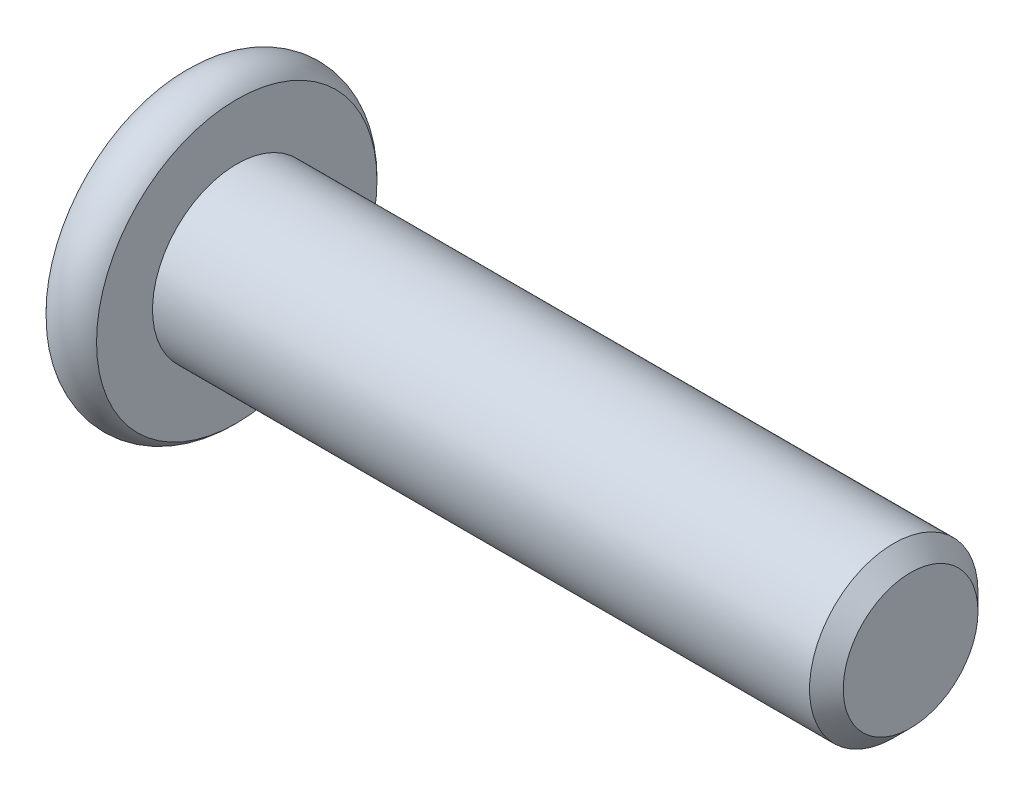
ISO-10303-21;
HEADER;
FILE_DESCRIPTION(('STEP AP214'),'2;1');
FILE_NAME('part.step','',(''),(''),'','','');
FILE_SCHEMA(('AUTOMOTIVE_DESIGN { 1 0 10303 214 1 1 1 1 }'));
ENDSEC;
DATA;
#1=APPLICATION_CONTEXT('core data for automotive mechanical design processes');
#2=APPLICATION_PROTOCOL_DEFINITION('international standard','automotive_design',2000,#1);
#3=PRODUCT_CONTEXT('',#1,'mechanical');
#4=PRODUCT('Part','Part','',(#3));
#5=PRODUCT_RELATED_PRODUCT_CATEGORY('part','',(#4));
#6=PRODUCT_DEFINITION_FORMATION('','',#4);
#7=PRODUCT_DEFINITION_CONTEXT('part definition',#1,'design');
#8=PRODUCT_DEFINITION('design','',#6,#7);
#9=PRODUCT_DEFINITION_SHAPE('','',#8);
#10=(LENGTH_UNIT() NAMED_UNIT(*) SI_UNIT(.MILLI.,.METRE.));
#11=(NAMED_UNIT(*) PLANE_ANGLE_UNIT() SI_UNIT($,.RADIAN.));
#12=(NAMED_UNIT(*) SI_UNIT($,.STERADIAN.) SOLID_ANGLE_UNIT());
#13=UNCERTAINTY_MEASURE_WITH_UNIT(LENGTH_MEASURE(1.E-05),#10,'distance_accuracy_value','');
#14=(GEOMETRIC_REPRESENTATION_CONTEXT(3) GLOBAL_UNCERTAINTY_ASSIGNED_CONTEXT((#13)) GLOBAL_UNIT_ASSIGNED_CONTEXT((#10,
#11,#12)) REPRESENTATION_CONTEXT('',''));
#15=CARTESIAN_POINT('',(0.,0.,0.));
#16=DIRECTION('',(0.,0.,1.));
#17=DIRECTION('',(1.,0.,0.));
#18=AXIS2_PLACEMENT_3D('',#15,#16,#17);
#19=CARTESIAN_POINT('',(-20.,0.,0.));
#20=DIRECTION('',(1.,0.,0.));
#21=DIRECTION('',(0.,0.,-1.));
#22=AXIS2_PLACEMENT_3D('',#19,#20,#21);
#23=CYLINDRICAL_SURFACE('',#22,2.5);
#24=CARTESIAN_POINT('',(-0.5,0.,0.));
#25=DIRECTION('',(1.,0.,0.));
#26=DIRECTION('',(0.,0.,-1.));
#27=AXIS2_PLACEMENT_3D('',#24,#25,#26);
#28=CIRCLE('',#27,2.5);
#29=CARTESIAN_POINT('',(-0.5,0.,-2.5));
#30=VERTEX_POINT('',#29);
#31=EDGE_CURVE('E48',#30,#30,#28,.F.);
#32=ORIENTED_EDGE('',*,*,#31,.T.);
#33=EDGE_LOOP('',(#32));
#34=FACE_BOUND('',#33,.T.);
#35=CARTESIAN_POINT('',(-20.,0.,0.));
#36=DIRECTION('',(-1.,0.,0.));
#37=DIRECTION('',(0.,-1.,0.));
#38=AXIS2_PLACEMENT_3D('',#35,#36,#37);
#39=CIRCLE('',#38,2.5);
#40=CARTESIAN_POINT('',(-20.,-2.50000000000001,0.));
#41=VERTEX_POINT('',#40);
#42=EDGE_CURVE('E124',#41,#41,#39,.F.);
#43=ORIENTED_EDGE('',*,*,#42,.T.);
#44=EDGE_LOOP('',(#43));
#45=FACE_BOUND('',#44,.T.);
#46=ADVANCED_FACE('F34',(#34,#45),#23,.T.);
#47=CARTESIAN_POINT('',(0.,0.,0.));
#48=DIRECTION('',(1.,0.,0.));
#49=DIRECTION('',(0.,0.,-1.));
#50=AXIS2_PLACEMENT_3D('',#47,#48,#49);
#51=PLANE('',#50);
#52=CARTESIAN_POINT('',(0.,0.,0.));
#53=DIRECTION('',(1.,0.,0.));
#54=DIRECTION('',(0.,0.,-1.));
#55=AXIS2_PLACEMENT_3D('',#52,#53,#54);
#56=CIRCLE('',#55,2.);
#57=CARTESIAN_POINT('',(0.,0.,-2.));
#58=VERTEX_POINT('',#57);
#59=EDGE_CURVE('E127',#58,#58,#56,.T.);
#60=ORIENTED_EDGE('',*,*,#59,.T.);
#61=EDGE_LOOP('',(#60));
#62=FACE_BOUND('',#61,.T.);
#63=ADVANCED_FACE('F137',(#62),#51,.T.);
#64=CARTESIAN_POINT('',(0.,0.,0.));
#65=DIRECTION('',(-1.,0.,0.));
#66=DIRECTION('',(0.,0.,1.));
#67=AXIS2_PLACEMENT_3D('',#64,#65,#66);
#68=CONICAL_SURFACE('',#67,2.,0.785398163397446);
#69=ORIENTED_EDGE('',*,*,#31,.F.);
#70=EDGE_LOOP('',(#69));
#71=FACE_BOUND('',#70,.T.);
#72=ORIENTED_EDGE('',*,*,#59,.F.);
#73=EDGE_LOOP('',(#72));
#74=FACE_BOUND('',#73,.T.);
#75=ADVANCED_FACE('F36',(#71,#74),#68,.T.);
#76=CARTESIAN_POINT('',(-21.5,0.,0.));
#77=DIRECTION('',(1.,0.,0.));
#78=DIRECTION('',(0.,1.,0.));
#79=AXIS2_PLACEMENT_3D('',#76,#77,#78);
#80=PLANE('',#79);
#81=CARTESIAN_POINT('',(-21.5,0.,0.));
#82=DIRECTION('',(-1.,0.,0.));
#83=DIRECTION('',(0.,-1.,0.));
#84=AXIS2_PLACEMENT_3D('',#81,#82,#83);
#85=CIRCLE('',#84,1.78205080756886);
#86=CARTESIAN_POINT('',(-21.5,-1.78205080756877,0.));
#87=VERTEX_POINT('',#86);
#88=EDGE_CURVE('E242',#87,#87,#85,.T.);
#89=ORIENTED_EDGE('',*,*,#88,.F.);
#90=EDGE_LOOP('',(#89));
#91=FACE_BOUND('',#90,.T.);
#92=CARTESIAN_POINT('',(-21.5,0.,0.));
#93=DIRECTION('',(-1.,0.,0.));
#94=DIRECTION('',(0.,-1.,0.));
#95=AXIS2_PLACEMENT_3D('',#92,#93,#94);
#96=CIRCLE('',#95,4.16143782776615);
#97=CARTESIAN_POINT('',(-21.5,-4.16143782776614,0.));
#98=VERTEX_POINT('',#97);
#99=EDGE_CURVE('E121',#98,#98,#96,.T.);
#100=ORIENTED_EDGE('',*,*,#99,.T.);
#101=EDGE_LOOP('',(#100));
#102=FACE_BOUND('',#101,.T.);
#103=ADVANCED_FACE('F136',(#91,#102),#80,.F.);
#104=CARTESIAN_POINT('',(-20.75,0.,0.));
#105=DIRECTION('',(-1.,0.,0.));
#106=DIRECTION('',(0.,-1.,0.));
#107=AXIS2_PLACEMENT_3D('',#104,#105,#106);
#108=TOROIDAL_SURFACE('',#107,3.5,1.);
#109=ORIENTED_EDGE('',*,*,#99,.F.);
#110=EDGE_LOOP('',(#109));
#111=FACE_BOUND('',#110,.T.);
#112=CARTESIAN_POINT('',(-20.,0.,0.));
#113=DIRECTION('',(-1.,0.,0.));
#114=DIRECTION('',(0.,-1.,0.));
#115=AXIS2_PLACEMENT_3D('',#112,#113,#114);
#116=CIRCLE('',#115,4.16143782776615);
#117=CARTESIAN_POINT('',(-20.,-4.16143782776615,0.));
#118=VERTEX_POINT('',#117);
#119=EDGE_CURVE('E118',#118,#118,#116,.T.);
#120=ORIENTED_EDGE('',*,*,#119,.T.);
#121=EDGE_LOOP('',(#120));
#122=FACE_BOUND('',#121,.T.);
#123=ADVANCED_FACE('F148',(#111,#122),#108,.T.);
#124=CARTESIAN_POINT('',(-20.,4.16143782776615,0.));
#125=DIRECTION('',(-1.,0.,0.));
#126=DIRECTION('',(0.,-1.,0.));
#127=AXIS2_PLACEMENT_3D('',#124,#125,#126);
#128=PLANE('',#127);
#129=ORIENTED_EDGE('',*,*,#42,.F.);
#130=EDGE_LOOP('',(#129));
#131=FACE_BOUND('',#130,.T.);
#132=ORIENTED_EDGE('',*,*,#119,.F.);
#133=EDGE_LOOP('',(#132));
#134=FACE_BOUND('',#133,.T.);
#135=ADVANCED_FACE('F152',(#131,#134),#128,.F.);
#136=CARTESIAN_POINT('',(-21.5,0.,0.));
#137=DIRECTION('',(-1.,0.,0.));
#138=DIRECTION('',(0.,-1.,0.));
#139=AXIS2_PLACEMENT_3D('',#136,#137,#138);
#140=CONICAL_SURFACE('',#139,1.78205080756886,0.78539816339745);
#141=ORIENTED_EDGE('',*,*,#88,.T.);
#142=EDGE_LOOP('',(#141));
#143=FACE_BOUND('',#142,.T.);
#144=CARTESIAN_POINT('',(-22.015428085613,-1.74023253176573,1.5));
#145=CARTESIAN_POINT('',(-21.9833811073445,-1.69791724929727,1.5));
#146=CARTESIAN_POINT('',(-21.9516444672841,-1.65536760966788,1.5));
#147=CARTESIAN_POINT('',(-21.8889203936153,-1.56970398156681,1.5));
#148=CARTESIAN_POINT('',(-21.85793314822,-1.52658985542845,1.5));
#149=CARTESIAN_POINT('',(-21.765846164345,-1.39562626326559,1.5));
#150=CARTESIAN_POINT('',(-21.7061145123021,-1.30679868010572,1.5));
#151=CARTESIAN_POINT('',(-21.5887342891012,-1.12044622640211,1.5));
#152=CARTESIAN_POINT('',(-21.5314082774823,-1.02271587306669,1.5));
#153=CARTESIAN_POINT('',(-21.426463214976,-0.822357214965219,1.5));
#154=CARTESIAN_POINT('',(-21.3788114236896,-0.719746931701882,1.5));
#155=CARTESIAN_POINT('',(-21.320509988315,-0.565852387095054,1.5));
#156=CARTESIAN_POINT('',(-21.3037990535409,-0.516874191424642,1.5));
#157=CARTESIAN_POINT('',(-21.2743077515089,-0.41772398845748,1.5));
#158=CARTESIAN_POINT('',(-21.2615276514219,-0.367551900263847,1.5));
#159=CARTESIAN_POINT('',(-21.2407784202458,-0.267158299056097,1.5));
#160=CARTESIAN_POINT('',(-21.2327260618259,-0.216954261864833,1.5));
#161=CARTESIAN_POINT('',(-21.221591636834,-0.115994915871297,1.5));
#162=CARTESIAN_POINT('',(-21.2185086886377,-0.0652397064615148,1.5));
#163=CARTESIAN_POINT('',(-21.2175473897404,0.0344222234875812,1.5));
#164=CARTESIAN_POINT('',(-21.2194789216952,0.0833271701101152,1.5));
#165=CARTESIAN_POINT('',(-21.2280175729677,0.180724293127248,1.5));
#166=CARTESIAN_POINT('',(-21.234625142048,0.229216429361756,1.5));
#167=CARTESIAN_POINT('',(-21.2522650626447,0.326258027697034,1.5));
#168=CARTESIAN_POINT('',(-21.263373168201,0.374793507450053,1.5));
#169=CARTESIAN_POINT('',(-21.2894198669595,0.470802295834207,1.5));
#170=CARTESIAN_POINT('',(-21.3043581560035,0.518275688481311,1.5));
#171=CARTESIAN_POINT('',(-21.356839545716,0.667150562065161,1.5));
#172=CARTESIAN_POINT('',(-21.4003351165442,0.766448362426881,1.5));
#173=CARTESIAN_POINT('',(-21.4970587814836,0.960384405673869,1.5));
#174=CARTESIAN_POINT('',(-21.5503217226675,1.05500437383624,1.5));
#175=CARTESIAN_POINT('',(-21.6602258010453,1.23584520321535,1.5));
#176=CARTESIAN_POINT('',(-21.7165682531046,1.32224986946553,1.5));
#177=CARTESIAN_POINT('',(-21.803675572597,1.44954953726477,1.5));
#178=CARTESIAN_POINT('',(-21.8330199906839,1.49143368482427,1.5));
#179=CARTESIAN_POINT('',(-21.8924869182931,1.57462914783248,1.5));
#180=CARTESIAN_POINT('',(-21.9226092115007,1.61594061772583,1.5));
#181=CARTESIAN_POINT('',(-21.9530541181366,1.65701358742556,1.5));
#182=B_SPLINE_CURVE_WITH_KNOTS('',3,(#144,#145,#146,#147,#148,#149,#150,#151,#152,#153,#154,
#155,#156,#157,#158,#159,#160,#161,#162,#163,#164,#165,#166,#167,#168,#169,#170,#171,#172,#173,
#174,#175,#176,#177,#178,#179,#180,#181),.UNSPECIFIED.,.F.,.F.,(4,2,2,2,2,2,2,2,2,2,2,2,2,2,2,2,
2,2,4),(0.,0.159238974218354,0.318517535014543,0.639504781932386,0.979137893799193,
1.31760168934357,1.47272233841624,1.62785352839775,1.78016486537346,1.93244917778279,
2.07904486260297,2.22565464958332,2.37484213303399,2.52401777304039,2.84828365283775,
3.1737297566675,3.48303030530537,3.63644667013909,3.78982082222913),.UNSPECIFIED.);
#183=CARTESIAN_POINT('',(-21.45,-0.866025403784357,1.5));
#184=VERTEX_POINT('',#183);
#185=CARTESIAN_POINT('',(-21.45,0.866025403784521,1.5));
#186=VERTEX_POINT('',#185);
#187=EDGE_CURVE('E102',#184,#186,#182,.T.);
#188=ORIENTED_EDGE('',*,*,#187,.F.);
#189=CARTESIAN_POINT('',(-21.4501154816001,-1.73216627762263,-0.0002000000000008));
#190=CARTESIAN_POINT('',(-21.4203654760674,-1.70239359975907,0.0513677907370744));
#191=CARTESIAN_POINT('',(-21.3923624839103,-1.67212305186347,0.103797917665199));
#192=CARTESIAN_POINT('',(-21.3410892304402,-1.61039789003611,0.210709034055595));
#193=CARTESIAN_POINT('',(-21.3178475050444,-1.57893740312606,0.26520019581466));
#194=CARTESIAN_POINT('',(-21.2780337289922,-1.51549879897979,0.375079081357248));
#195=CARTESIAN_POINT('',(-21.2613615856709,-1.48353684526802,0.430438809095199));
#196=CARTESIAN_POINT('',(-21.2356744568181,-1.41890915196203,0.54237725747715));
#197=CARTESIAN_POINT('',(-21.2266402904789,-1.3862453878111,0.598952556553009));
#198=CARTESIAN_POINT('',(-21.2184890812269,-1.32995210095291,0.696455389516442));
#199=CARTESIAN_POINT('',(-21.2172822529892,-1.30639533311116,0.737256908280467));
#200=CARTESIAN_POINT('',(-21.2193140571623,-1.25932335290185,0.818787969615859));
#201=CARTESIAN_POINT('',(-21.2225536707483,-1.23580815085305,0.859517494314631));
#202=CARTESIAN_POINT('',(-21.233291985982,-1.18900414978418,0.940584402163417));
#203=CARTESIAN_POINT('',(-21.2407946530188,-1.16571558211711,0.980921384598289));
#204=CARTESIAN_POINT('',(-21.2596516119283,-1.11952932016327,1.06091833691403));
#205=CARTESIAN_POINT('',(-21.2710075570186,-1.09663179808778,1.10057800851621));
#206=CARTESIAN_POINT('',(-21.3047216475927,-1.0379815980969,1.20216313477449));
#207=CARTESIAN_POINT('',(-21.3296218490934,-1.00259267147457,1.26345855370969));
#208=CARTESIAN_POINT('',(-21.3716566532716,-0.950557780604292,1.35358562846331));
#209=CARTESIAN_POINT('',(-21.3864251535591,-0.933410759677065,1.38328513990772));
#210=CARTESIAN_POINT('',(-21.4173105659402,-0.899432101996325,1.44213790138375));
#211=CARTESIAN_POINT('',(-21.4334268341217,-0.882600319285629,1.47129140422064));
#212=CARTESIAN_POINT('',(-21.4501154816001,-0.865909933730519,1.5002));
#213=B_SPLINE_CURVE_WITH_KNOTS('',3,(#189,#190,#191,#192,#193,#194,#195,#196,#197,#198,#199,
#200,#201,#202,#203,#204,#205,#206,#207,#208,#209,#210,#211,#212),.UNSPECIFIED.,.F.,.F.,(4,2,2,
2,2,2,2,2,2,2,2,4),(0.,0.199829143693305,0.400822987382389,0.598623720538181,0.795926240188891,
0.937113067959883,1.07833105577193,1.21968061668222,1.36109089931055,1.58570969637566,
1.69770705470964,1.80965120737194),.UNSPECIFIED.);
#214=CARTESIAN_POINT('',(-21.45,-1.73205080756879,0.));
#215=VERTEX_POINT('',#214);
#216=EDGE_CURVE('E198',#215,#184,#213,.T.);
#217=ORIENTED_EDGE('',*,*,#216,.F.);
#218=CARTESIAN_POINT('',(-21.4501154816001,-0.865909933730519,-1.5002));
#219=CARTESIAN_POINT('',(-21.4203654760674,-0.895682611594084,-1.44863220926292));
#220=CARTESIAN_POINT('',(-21.3923624839103,-0.925953159489683,-1.3962020823348));
#221=CARTESIAN_POINT('',(-21.3410892304402,-0.987678321317041,-1.2892909659444));
#222=CARTESIAN_POINT('',(-21.3178475050444,-1.01913880822709,-1.23479980418534));
#223=CARTESIAN_POINT('',(-21.2780337289922,-1.08257741237336,-1.12492091864275));
#224=CARTESIAN_POINT('',(-21.2613615856709,-1.11453936608513,-1.0695611909048));
#225=CARTESIAN_POINT('',(-21.2356744568181,-1.17916705939112,-0.957622742522851));
#226=CARTESIAN_POINT('',(-21.2266402904789,-1.21183082354205,-0.901047443446993));
#227=CARTESIAN_POINT('',(-21.2184890812269,-1.26812411040024,-0.80354461048356));
#228=CARTESIAN_POINT('',(-21.2172822529892,-1.291680878242,-0.762743091719535));
#229=CARTESIAN_POINT('',(-21.2193140571623,-1.3387528584513,-0.681212030384143));
#230=CARTESIAN_POINT('',(-21.2225536707483,-1.3622680605001,-0.640482505685371));
#231=CARTESIAN_POINT('',(-21.233291985982,-1.40907206156897,-0.559415597836585));
#232=CARTESIAN_POINT('',(-21.2407946530188,-1.43236062923604,-0.519078615401714));
#233=CARTESIAN_POINT('',(-21.2596516119283,-1.47854689118988,-0.439081663085971));
#234=CARTESIAN_POINT('',(-21.2710075570186,-1.50144441326537,-0.399421991483794));
#235=CARTESIAN_POINT('',(-21.3047216475927,-1.56009461325625,-0.297836865225517));
#236=CARTESIAN_POINT('',(-21.3296218490934,-1.59548353987858,-0.236541446290313));
#237=CARTESIAN_POINT('',(-21.3716566532716,-1.64751843074886,-0.146414371536688));
#238=CARTESIAN_POINT('',(-21.3864251535591,-1.66466545167609,-0.116714860092285));
#239=CARTESIAN_POINT('',(-21.4173105659402,-1.69864410935683,-0.0578620986162509));
#240=CARTESIAN_POINT('',(-21.4334268341217,-1.71547589206752,-0.0287085957793639));
#241=CARTESIAN_POINT('',(-21.4501154816001,-1.73216627762263,0.00019999999999943));
#242=B_SPLINE_CURVE_WITH_KNOTS('',3,(#218,#219,#220,#221,#222,#223,#224,#225,#226,#227,#228,
#229,#230,#231,#232,#233,#234,#235,#236,#237,#238,#239,#240,#241),.UNSPECIFIED.,.F.,.F.,(4,2,2,
2,2,2,2,2,2,2,2,4),(0.,0.199829143693304,0.400822987382386,0.598623720538178,0.795926240188888,
0.937113067959879,1.07833105577193,1.21968061668222,1.36109089931054,1.58570969637565,
1.69770705470963,1.80965120737194),.UNSPECIFIED.);
#243=CARTESIAN_POINT('',(-21.45,-0.866025403784356,-1.5));
#244=VERTEX_POINT('',#243);
#245=EDGE_CURVE('E192',#244,#215,#242,.T.);
#246=ORIENTED_EDGE('',*,*,#245,.F.);
#247=CARTESIAN_POINT('',(-22.0154280857208,-1.74023253190806,-1.5));
#248=CARTESIAN_POINT('',(-21.9833811074482,-1.69791724943558,-1.5));
#249=CARTESIAN_POINT('',(-21.9516444673836,-1.65536760980217,-1.5));
#250=CARTESIAN_POINT('',(-21.8889203937065,-1.569703981693,-1.5));
#251=CARTESIAN_POINT('',(-21.8579331483071,-1.52658985555058,-1.5));
#252=CARTESIAN_POINT('',(-21.7658461644196,-1.39562626337528,-1.5));
#253=CARTESIAN_POINT('',(-21.7061145123685,-1.30679868020694,-1.5));
#254=CARTESIAN_POINT('',(-21.5887342891506,-1.12044622648488,-1.5));
#255=CARTESIAN_POINT('',(-21.5314082775229,-1.02271587313942,-1.5));
#256=CARTESIAN_POINT('',(-21.4264632150005,-0.822357215017008,-1.5));
#257=CARTESIAN_POINT('',(-21.3788114237068,-0.719746931742781,-1.5));
#258=CARTESIAN_POINT('',(-21.3205099883267,-0.565852387127772,-1.5));
#259=CARTESIAN_POINT('',(-21.3037990535528,-0.516874191460807,-1.5));
#260=CARTESIAN_POINT('',(-21.2743077515206,-0.417723988500656,-1.5));
#261=CARTESIAN_POINT('',(-21.2615276514332,-0.367551900310585,-1.5));
#262=CARTESIAN_POINT('',(-21.2407784202553,-0.267158299109846,-1.5));
#263=CARTESIAN_POINT('',(-21.2327260618343,-0.216954261922027,-1.5));
#264=CARTESIAN_POINT('',(-21.2215916368391,-0.11599491593527,-1.5));
#265=CARTESIAN_POINT('',(-21.2185086886407,-0.0652397065288216,-1.5));
#266=CARTESIAN_POINT('',(-21.2175473897388,0.0344222234142057,-1.5));
#267=CARTESIAN_POINT('',(-21.219478921691,0.0833271700339959,-1.5));
#268=CARTESIAN_POINT('',(-21.228017572958,0.18072429304592,-1.5));
#269=CARTESIAN_POINT('',(-21.2346251420354,0.229216429277964,-1.5));
#270=CARTESIAN_POINT('',(-21.2522650626259,0.326258027608378,-1.5));
#271=CARTESIAN_POINT('',(-21.2633731681789,0.374793507359005,-1.5));
#272=CARTESIAN_POINT('',(-21.2894198669309,0.470802295738608,-1.5));
#273=CARTESIAN_POINT('',(-21.3043581559716,0.518275688383553,-1.5));
#274=CARTESIAN_POINT('',(-21.3568395456685,0.667150561946207,-1.5));
#275=CARTESIAN_POINT('',(-21.4003351164824,0.766448362289951,-1.5));
#276=CARTESIAN_POINT('',(-21.4970587813916,0.960384405502367,-1.5));
#277=CARTESIAN_POINT('',(-21.5503217225595,1.05500437364815,-1.5));
#278=CARTESIAN_POINT('',(-21.6602258009069,1.23584520299745,-1.5));
#279=CARTESIAN_POINT('',(-21.7165682529518,1.32224986923429,-1.5));
#280=CARTESIAN_POINT('',(-21.8036755724226,1.44954953701381,-1.5));
#281=CARTESIAN_POINT('',(-21.8330199905024,1.49143368456684,-1.5));
#282=CARTESIAN_POINT('',(-21.8924869180973,1.57462914756214,-1.5));
#283=CARTESIAN_POINT('',(-21.9226092112979,1.61594061744905,-1.5));
#284=CARTESIAN_POINT('',(-21.9530541179266,1.65701358714236,-1.5));
#285=B_SPLINE_CURVE_WITH_KNOTS('',3,(#247,#248,#249,#250,#251,#252,#253,#254,#255,#256,#257,
#258,#259,#260,#261,#262,#263,#264,#265,#266,#267,#268,#269,#270,#271,#272,#273,#274,#275,#276,
#277,#278,#279,#280,#281,#282,#283,#284),.UNSPECIFIED.,.F.,.F.,(4,2,2,2,2,2,2,2,2,2,2,2,2,2,2,2,
2,2,4),(0.,0.159238974235481,0.318517535048797,0.63950478200154,0.979137893907506,
1.31760168949067,1.47272233855334,1.62785352852489,1.78016486549104,1.93244917789081,
2.0790448627025,2.22565464967435,2.37484213311584,2.52401777311309,2.8482836528441,
3.17372975660706,3.4830303051878,3.63644666999334,3.78982082205521),.UNSPECIFIED.);
#286=CARTESIAN_POINT('',(-21.45,0.866025403784521,-1.5));
#287=VERTEX_POINT('',#286);
#288=EDGE_CURVE('E55',#287,#244,#285,.F.);
#289=ORIENTED_EDGE('',*,*,#288,.F.);
#290=CARTESIAN_POINT('',(-21.4501154816001,1.7321662776228,0.00020000000000003));
#291=CARTESIAN_POINT('',(-21.4203654760673,1.70239359975923,-0.0513677907370759));
#292=CARTESIAN_POINT('',(-21.3923624839103,1.67212305186363,-0.103797917665201));
#293=CARTESIAN_POINT('',(-21.3410892304402,1.61039789003627,-0.210709034055597));
#294=CARTESIAN_POINT('',(-21.3178475050444,1.57893740312622,-0.265200195814661));
#295=CARTESIAN_POINT('',(-21.2780337289922,1.51549879897995,-0.375079081357247));
#296=CARTESIAN_POINT('',(-21.2613615856709,1.48353684526818,-0.430438809095198));
#297=CARTESIAN_POINT('',(-21.2356744568181,1.4189091519622,-0.542377257477149));
#298=CARTESIAN_POINT('',(-21.2266402904789,1.38624538781127,-0.598952556553007));
#299=CARTESIAN_POINT('',(-21.2184890812269,1.32995210095308,-0.696455389516439));
#300=CARTESIAN_POINT('',(-21.2172822529892,1.30639533311132,-0.737256908280464));
#301=CARTESIAN_POINT('',(-21.2193140571623,1.25932335290202,-0.818787969615856));
#302=CARTESIAN_POINT('',(-21.2225536707483,1.23580815085322,-0.859517494314628));
#303=CARTESIAN_POINT('',(-21.233291985982,1.18900414978435,-0.940584402163414));
#304=CARTESIAN_POINT('',(-21.2407946530187,1.16571558211728,-0.980921384598287));
#305=CARTESIAN_POINT('',(-21.2596516119283,1.11952932016343,-1.06091833691403));
#306=CARTESIAN_POINT('',(-21.2710075570186,1.09663179808795,-1.10057800851621));
#307=CARTESIAN_POINT('',(-21.3047216475927,1.03798159809707,-1.20216313477448));
#308=CARTESIAN_POINT('',(-21.3296218490934,1.00259267147474,-1.26345855370969));
#309=CARTESIAN_POINT('',(-21.3716566532716,0.950557780604457,-1.35358562846331));
#310=CARTESIAN_POINT('',(-21.3864251535591,0.93341075967723,-1.38328513990772));
#311=CARTESIAN_POINT('',(-21.4173105659402,0.89943210199649,-1.44213790138375));
#312=CARTESIAN_POINT('',(-21.4334268341217,0.882600319285793,-1.47129140422064));
#313=CARTESIAN_POINT('',(-21.4501154816001,0.865909933730683,-1.5002));
#314=B_SPLINE_CURVE_WITH_KNOTS('',3,(#290,#291,#292,#293,#294,#295,#296,#297,#298,#299,#300,
#301,#302,#303,#304,#305,#306,#307,#308,#309,#310,#311,#312,#313),.UNSPECIFIED.,.F.,.F.,(4,2,2,
2,2,2,2,2,2,2,2,4),(0.,0.199829143693305,0.400822987382387,0.598623720538179,0.795926240188887,
0.937113067959879,1.07833105577193,1.21968061668222,1.36109089931054,1.58570969637565,
1.69770705470963,1.80965120737194),.UNSPECIFIED.);
#315=CARTESIAN_POINT('',(-21.45,1.73205080756896,0.));
#316=VERTEX_POINT('',#315);
#317=EDGE_CURVE('E11',#316,#287,#314,.T.);
#318=ORIENTED_EDGE('',*,*,#317,.F.);
#319=CARTESIAN_POINT('',(-21.4501154816001,0.865909933730683,1.5002));
#320=CARTESIAN_POINT('',(-21.4203654760673,0.895682611594248,1.44863220926292));
#321=CARTESIAN_POINT('',(-21.3923624839103,0.925953159489847,1.3962020823348));
#322=CARTESIAN_POINT('',(-21.3410892304402,0.987678321317206,1.2892909659444));
#323=CARTESIAN_POINT('',(-21.3178475050444,1.01913880822726,1.23479980418534));
#324=CARTESIAN_POINT('',(-21.2780337289922,1.08257741237353,1.12492091864275));
#325=CARTESIAN_POINT('',(-21.2613615856709,1.1145393660853,1.0695611909048));
#326=CARTESIAN_POINT('',(-21.2356744568181,1.17916705939129,0.957622742522847));
#327=CARTESIAN_POINT('',(-21.2266402904789,1.21183082354222,0.901047443446989));
#328=CARTESIAN_POINT('',(-21.2184890812269,1.2681241104004,0.803544610483557));
#329=CARTESIAN_POINT('',(-21.2172822529892,1.29168087824216,0.762743091719531));
#330=CARTESIAN_POINT('',(-21.2193140571623,1.33875285845146,0.681212030384139));
#331=CARTESIAN_POINT('',(-21.2225536707483,1.36226806050027,0.640482505685368));
#332=CARTESIAN_POINT('',(-21.233291985982,1.40907206156913,0.559415597836582));
#333=CARTESIAN_POINT('',(-21.2407946530187,1.4323606292362,0.51907861540171));
#334=CARTESIAN_POINT('',(-21.2596516119283,1.47854689119005,0.439081663085967));
#335=CARTESIAN_POINT('',(-21.2710075570186,1.50144441326554,0.39942199148379));
#336=CARTESIAN_POINT('',(-21.3047216475927,1.56009461325641,0.297836865225514));
#337=CARTESIAN_POINT('',(-21.3296218490934,1.59548353987875,0.23654144629031));
#338=CARTESIAN_POINT('',(-21.3716566532716,1.64751843074902,0.146414371536686));
#339=CARTESIAN_POINT('',(-21.3864251535591,1.66466545167625,0.116714860092283));
#340=CARTESIAN_POINT('',(-21.4173105659402,1.69864410935699,0.05786209861625));
#341=CARTESIAN_POINT('',(-21.4334268341217,1.71547589206769,0.0287085957793637));
#342=CARTESIAN_POINT('',(-21.4501154816001,1.7321662776228,-0.000199999999999372));
#343=B_SPLINE_CURVE_WITH_KNOTS('',3,(#319,#320,#321,#322,#323,#324,#325,#326,#327,#328,#329,
#330,#331,#332,#333,#334,#335,#336,#337,#338,#339,#340,#341,#342),.UNSPECIFIED.,.F.,.F.,(4,2,2,
2,2,2,2,2,2,2,2,4),(0.,0.199829143693306,0.40082298738239,0.598623720538183,0.795926240188891,
0.937113067959883,1.07833105577193,1.21968061668222,1.36109089931055,1.58570969637565,
1.69770705470963,1.80965120737193),.UNSPECIFIED.);
#344=EDGE_CURVE('E93',#186,#316,#343,.T.);
#345=ORIENTED_EDGE('',*,*,#344,.F.);
#346=EDGE_LOOP('',(#188,#217,#246,#289,#318,#345));
#347=FACE_BOUND('',#346,.T.);
#348=ADVANCED_FACE('F92',(#143,#347),#140,.F.);
#349=CARTESIAN_POINT('',(-19.2,0.,0.));
#350=DIRECTION('',(-1.,0.,0.));
#351=DIRECTION('',(0.,-1.,0.));
#352=AXIS2_PLACEMENT_3D('',#349,#350,#351);
#353=PLANE('',#352);
#354=DIRECTION('',(0.,0.5,-0.866025403784438));
#355=VECTOR('',#354,1.);
#356=CARTESIAN_POINT('',(-19.2,0.866025403784512,1.5));
#357=LINE('',#356,#355);
#358=CARTESIAN_POINT('',(-19.2,0.866025403784512,1.5));
#359=VERTEX_POINT('',#358);
#360=CARTESIAN_POINT('',(-19.2,1.73205080756895,0.));
#361=VERTEX_POINT('',#360);
#362=EDGE_CURVE('E101',#359,#361,#357,.T.);
#363=ORIENTED_EDGE('',*,*,#362,.T.);
#364=DIRECTION('',(0.,-0.5,-0.866025403784439));
#365=VECTOR('',#364,1.);
#366=CARTESIAN_POINT('',(-19.2,1.73205080756895,0.));
#367=LINE('',#366,#365);
#368=CARTESIAN_POINT('',(-19.2,0.866025403784512,-1.5));
#369=VERTEX_POINT('',#368);
#370=EDGE_CURVE('E106',#361,#369,#367,.T.);
#371=ORIENTED_EDGE('',*,*,#370,.T.);
#372=DIRECTION('',(0.,-1.,0.));
#373=VECTOR('',#372,1.);
#374=CARTESIAN_POINT('',(-19.2,0.866025403784512,-1.5));
#375=LINE('',#374,#373);
#376=CARTESIAN_POINT('',(-19.2,-0.866025403784365,-1.5));
#377=VERTEX_POINT('',#376);
#378=EDGE_CURVE('E224',#369,#377,#375,.T.);
#379=ORIENTED_EDGE('',*,*,#378,.T.);
#380=DIRECTION('',(0.,-0.5,0.866025403784439));
#381=VECTOR('',#380,1.);
#382=CARTESIAN_POINT('',(-19.2,-0.866025403784365,-1.5));
#383=LINE('',#382,#381);
#384=CARTESIAN_POINT('',(-19.2,-1.7320508075688,0.));
#385=VERTEX_POINT('',#384);
#386=EDGE_CURVE('E228',#377,#385,#383,.T.);
#387=ORIENTED_EDGE('',*,*,#386,.T.);
#388=DIRECTION('',(0.,0.5,0.866025403784439));
#389=VECTOR('',#388,1.);
#390=CARTESIAN_POINT('',(-19.2,-1.7320508075688,0.));
#391=LINE('',#390,#389);
#392=CARTESIAN_POINT('',(-19.2,-0.866025403784366,1.5));
#393=VERTEX_POINT('',#392);
#394=EDGE_CURVE('E114',#385,#393,#391,.T.);
#395=ORIENTED_EDGE('',*,*,#394,.T.);
#396=DIRECTION('',(0.,1.,0.));
#397=VECTOR('',#396,1.);
#398=CARTESIAN_POINT('',(-19.2,-0.866025403784366,1.5));
#399=LINE('',#398,#397);
#400=EDGE_CURVE('E109',#393,#359,#399,.T.);
#401=ORIENTED_EDGE('',*,*,#400,.T.);
#402=EDGE_LOOP('',(#363,#371,#379,#387,#395,#401));
#403=FACE_BOUND('',#402,.T.);
#404=ADVANCED_FACE('F178',(#403),#353,.T.);
#405=CARTESIAN_POINT('',(-19.2,1.73205080756895,0.));
#406=DIRECTION('',(0.,0.866025403784439,-0.5));
#407=DIRECTION('',(0.,0.5,0.866025403784439));
#408=AXIS2_PLACEMENT_3D('',#405,#406,#407);
#409=PLANE('',#408);
#410=DIRECTION('',(-1.,0.,0.));
#411=VECTOR('',#410,1.);
#412=CARTESIAN_POINT('',(-19.2,1.73205080756895,0.));
#413=LINE('',#412,#411);
#414=EDGE_CURVE('E99',#361,#316,#413,.T.);
#415=ORIENTED_EDGE('',*,*,#414,.T.);
#416=ORIENTED_EDGE('',*,*,#317,.T.);
#417=DIRECTION('',(-1.,0.,0.));
#418=VECTOR('',#417,1.);
#419=CARTESIAN_POINT('',(-19.2,0.866025403784512,-1.5));
#420=LINE('',#419,#418);
#421=EDGE_CURVE('E108',#369,#287,#420,.T.);
#422=ORIENTED_EDGE('',*,*,#421,.F.);
#423=ORIENTED_EDGE('',*,*,#370,.F.);
#424=EDGE_LOOP('',(#415,#416,#422,#423));
#425=FACE_BOUND('',#424,.T.);
#426=ADVANCED_FACE('F104',(#425),#409,.F.);
#427=CARTESIAN_POINT('',(-19.2,0.866025403784512,-1.5));
#428=DIRECTION('',(0.,0.,-1.));
#429=DIRECTION('',(0.,1.,0.));
#430=AXIS2_PLACEMENT_3D('',#427,#428,#429);
#431=PLANE('',#430);
#432=ORIENTED_EDGE('',*,*,#421,.T.);
#433=ORIENTED_EDGE('',*,*,#288,.T.);
#434=DIRECTION('',(-1.,0.,0.));
#435=VECTOR('',#434,1.);
#436=CARTESIAN_POINT('',(-19.2,-0.866025403784365,-1.5));
#437=LINE('',#436,#435);
#438=EDGE_CURVE('E111',#377,#244,#437,.T.);
#439=ORIENTED_EDGE('',*,*,#438,.F.);
#440=ORIENTED_EDGE('',*,*,#378,.F.);
#441=EDGE_LOOP('',(#432,#433,#439,#440));
#442=FACE_BOUND('',#441,.T.);
#443=ADVANCED_FACE('F213',(#442),#431,.F.);
#444=CARTESIAN_POINT('',(-19.2,-0.866025403784365,-1.5));
#445=DIRECTION('',(0.,-0.866025403784439,-0.5));
#446=DIRECTION('',(0.,0.5,-0.866025403784439));
#447=AXIS2_PLACEMENT_3D('',#444,#445,#446);
#448=PLANE('',#447);
#449=ORIENTED_EDGE('',*,*,#438,.T.);
#450=ORIENTED_EDGE('',*,*,#245,.T.);
#451=DIRECTION('',(-1.,0.,0.));
#452=VECTOR('',#451,1.);
#453=CARTESIAN_POINT('',(-19.2,-1.7320508075688,0.));
#454=LINE('',#453,#452);
#455=EDGE_CURVE('E238',#385,#215,#454,.T.);
#456=ORIENTED_EDGE('',*,*,#455,.F.);
#457=ORIENTED_EDGE('',*,*,#386,.F.);
#458=EDGE_LOOP('',(#449,#450,#456,#457));
#459=FACE_BOUND('',#458,.T.);
#460=ADVANCED_FACE('F208',(#459),#448,.F.);
#461=CARTESIAN_POINT('',(-19.2,-1.7320508075688,0.));
#462=DIRECTION('',(0.,-0.866025403784439,0.5));
#463=DIRECTION('',(0.,-0.5,-0.866025403784439));
#464=AXIS2_PLACEMENT_3D('',#461,#462,#463);
#465=PLANE('',#464);
#466=ORIENTED_EDGE('',*,*,#455,.T.);
#467=ORIENTED_EDGE('',*,*,#216,.T.);
#468=DIRECTION('',(-1.,0.,0.));
#469=VECTOR('',#468,1.);
#470=CARTESIAN_POINT('',(-19.2,-0.866025403784366,1.5));
#471=LINE('',#470,#469);
#472=EDGE_CURVE('E235',#393,#184,#471,.T.);
#473=ORIENTED_EDGE('',*,*,#472,.F.);
#474=ORIENTED_EDGE('',*,*,#394,.F.);
#475=EDGE_LOOP('',(#466,#467,#473,#474));
#476=FACE_BOUND('',#475,.T.);
#477=ADVANCED_FACE('F205',(#476),#465,.F.);
#478=CARTESIAN_POINT('',(-19.2,-0.866025403784366,1.5));
#479=DIRECTION('',(0.,0.,1.));
#480=DIRECTION('',(1.,0.,0.));
#481=AXIS2_PLACEMENT_3D('',#478,#479,#480);
#482=PLANE('',#481);
#483=ORIENTED_EDGE('',*,*,#472,.T.);
#484=ORIENTED_EDGE('',*,*,#187,.T.);
#485=DIRECTION('',(-1.,0.,0.));
#486=VECTOR('',#485,1.);
#487=CARTESIAN_POINT('',(-19.2,0.866025403784512,1.5));
#488=LINE('',#487,#486);
#489=EDGE_CURVE('E62',#359,#186,#488,.T.);
#490=ORIENTED_EDGE('',*,*,#489,.F.);
#491=ORIENTED_EDGE('',*,*,#400,.F.);
#492=EDGE_LOOP('',(#483,#484,#490,#491));
#493=FACE_BOUND('',#492,.T.);
#494=ADVANCED_FACE('F159',(#493),#482,.F.);
#495=CARTESIAN_POINT('',(-19.2,0.866025403784512,1.5));
#496=DIRECTION('',(0.,0.866025403784439,0.5));
#497=DIRECTION('',(0.,-0.5,0.866025403784439));
#498=AXIS2_PLACEMENT_3D('',#495,#496,#497);
#499=PLANE('',#498);
#500=ORIENTED_EDGE('',*,*,#489,.T.);
#501=ORIENTED_EDGE('',*,*,#344,.T.);
#502=ORIENTED_EDGE('',*,*,#414,.F.);
#503=ORIENTED_EDGE('',*,*,#362,.F.);
#504=EDGE_LOOP('',(#500,#501,#502,#503));
#505=FACE_BOUND('',#504,.T.);
#506=ADVANCED_FACE('F98',(#505),#499,.F.);
#507=CLOSED_SHELL('',(#46,#63,#75,#103,#123,#135,#348,#404,#426,#443,#460,#477,#494,#506));
#508=MANIFOLD_SOLID_BREP('B2',#507);
#509=ADVANCED_BREP_SHAPE_REPRESENTATION('',(#18,#508),#14);
#510=SHAPE_DEFINITION_REPRESENTATION(#9,#509);
ENDSEC;
END-ISO-10303-21;
